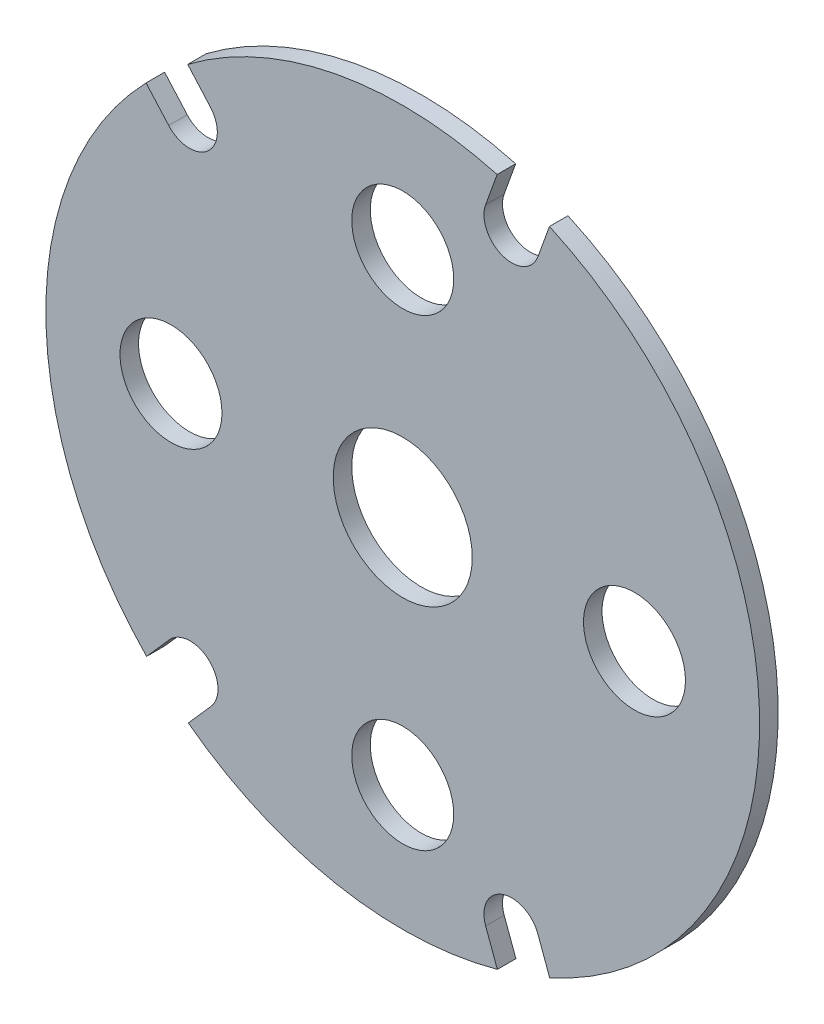
ISO-10303-21;
HEADER;
FILE_DESCRIPTION(('STEP AP214'),'2;1');
FILE_NAME('part.step','',(''),(''),'','','');
FILE_SCHEMA(('AUTOMOTIVE_DESIGN { 1 0 10303 214 1 1 1 1 }'));
ENDSEC;
DATA;
#1=APPLICATION_CONTEXT('core data for automotive mechanical design processes');
#2=APPLICATION_PROTOCOL_DEFINITION('international standard','automotive_design',2000,#1);
#3=PRODUCT_CONTEXT('',#1,'mechanical');
#4=PRODUCT('Part','Part','',(#3));
#5=PRODUCT_RELATED_PRODUCT_CATEGORY('part','',(#4));
#6=PRODUCT_DEFINITION_FORMATION('','',#4);
#7=PRODUCT_DEFINITION_CONTEXT('part definition',#1,'design');
#8=PRODUCT_DEFINITION('design','',#6,#7);
#9=PRODUCT_DEFINITION_SHAPE('','',#8);
#10=(LENGTH_UNIT() NAMED_UNIT(*) SI_UNIT(.MILLI.,.METRE.));
#11=(NAMED_UNIT(*) PLANE_ANGLE_UNIT() SI_UNIT($,.RADIAN.));
#12=(NAMED_UNIT(*) SI_UNIT($,.STERADIAN.) SOLID_ANGLE_UNIT());
#13=UNCERTAINTY_MEASURE_WITH_UNIT(LENGTH_MEASURE(1.E-05),#10,'distance_accuracy_value','');
#14=(GEOMETRIC_REPRESENTATION_CONTEXT(3) GLOBAL_UNCERTAINTY_ASSIGNED_CONTEXT((#13)) GLOBAL_UNIT_ASSIGNED_CONTEXT((#10,
#11,#12)) REPRESENTATION_CONTEXT('',''));
#15=CARTESIAN_POINT('',(0.,0.,0.));
#16=DIRECTION('',(0.,0.,1.));
#17=DIRECTION('',(1.,0.,0.));
#18=AXIS2_PLACEMENT_3D('',#15,#16,#17);
#19=CARTESIAN_POINT('',(0.,0.,2.));
#20=DIRECTION('',(0.,0.,-1.));
#21=DIRECTION('',(-1.,0.,0.));
#22=AXIS2_PLACEMENT_3D('',#19,#20,#21);
#23=PLANE('',#22);
#24=CARTESIAN_POINT('',(25.0000000000004,0.,2.));
#25=DIRECTION('',(0.,0.,1.));
#26=DIRECTION('',(1.,0.,0.));
#27=AXIS2_PLACEMENT_3D('',#24,#25,#26);
#28=CIRCLE('',#27,5.50000000000006);
#29=CARTESIAN_POINT('',(30.5000000000004,0.,2.));
#30=VERTEX_POINT('',#29);
#31=EDGE_CURVE('E348',#30,#30,#28,.T.);
#32=ORIENTED_EDGE('',*,*,#31,.F.);
#33=EDGE_LOOP('',(#32));
#34=FACE_BOUND('',#33,.T.);
#35=CARTESIAN_POINT('',(0.,24.9999999999999,2.));
#36=DIRECTION('',(0.,0.,1.));
#37=DIRECTION('',(1.,0.,0.));
#38=AXIS2_PLACEMENT_3D('',#35,#36,#37);
#39=CIRCLE('',#38,5.50000000000006);
#40=CARTESIAN_POINT('',(5.50000000000006,24.9999999999999,2.));
#41=VERTEX_POINT('',#40);
#42=EDGE_CURVE('E360',#41,#41,#39,.T.);
#43=ORIENTED_EDGE('',*,*,#42,.F.);
#44=EDGE_LOOP('',(#43));
#45=FACE_BOUND('',#44,.T.);
#46=CARTESIAN_POINT('',(0.,0.,2.));
#47=DIRECTION('',(0.,0.,1.));
#48=DIRECTION('',(-1.,0.,0.));
#49=AXIS2_PLACEMENT_3D('',#46,#47,#48);
#50=CIRCLE('',#49,38.5000000000003);
#51=CARTESIAN_POINT('',(10.183062278802,37.1289003692011,2.));
#52=VERTEX_POINT('',#51);
#53=CARTESIAN_POINT('',(-23.1958325761242,30.7278920705674,2.));
#54=VERTEX_POINT('',#53);
#55=EDGE_CURVE('E209',#52,#54,#50,.T.);
#56=ORIENTED_EDGE('',*,*,#55,.T.);
#57=DIRECTION('',(0.662848980359871,-0.748753116344686,0.));
#58=VECTOR('',#57,1.);
#59=CARTESIAN_POINT('',(-23.1958325761242,30.7278920705674,2.));
#60=LINE('',#59,#58);
#61=CARTESIAN_POINT('',(-20.7537406509684,27.9693090546173,2.));
#62=VERTEX_POINT('',#61);
#63=EDGE_CURVE('E117',#54,#62,#60,.T.);
#64=ORIENTED_EDGE('',*,*,#63,.T.);
#65=CARTESIAN_POINT('',(-23.0000000000027,25.9807621135375,2.));
#66=DIRECTION('',(0.,0.,-1.));
#67=DIRECTION('',(1.,0.,0.));
#68=AXIS2_PLACEMENT_3D('',#65,#66,#67);
#69=CIRCLE('',#68,3.00000000000025);
#70=CARTESIAN_POINT('',(-25.246259349037,23.9922151724578,2.));
#71=VERTEX_POINT('',#70);
#72=EDGE_CURVE('E248',#62,#71,#69,.T.);
#73=ORIENTED_EDGE('',*,*,#72,.T.);
#74=DIRECTION('',(-0.662848980359834,0.748753116344719,0.));
#75=VECTOR('',#74,1.);
#76=CARTESIAN_POINT('',(-27.6883512741927,26.7507981884081,2.));
#77=LINE('',#76,#75);
#78=CARTESIAN_POINT('',(-27.6883512741927,26.7507981884081,2.));
#79=VERTEX_POINT('',#78);
#80=EDGE_CURVE('E267',#71,#79,#77,.T.);
#81=ORIENTED_EDGE('',*,*,#80,.T.);
#82=CARTESIAN_POINT('',(0.,0.,2.));
#83=DIRECTION('',(0.,0.,1.));
#84=DIRECTION('',(1.,0.,0.));
#85=AXIS2_PLACEMENT_3D('',#82,#83,#84);
#86=CIRCLE('',#85,38.5000000000003);
#87=CARTESIAN_POINT('',(-27.63565024803,-26.8052389537677,2.));
#88=VERTEX_POINT('',#87);
#89=EDGE_CURVE('E264',#79,#88,#86,.T.);
#90=ORIENTED_EDGE('',*,*,#89,.T.);
#91=DIRECTION('',(0.661374099223641,0.750056198478566,0.));
#92=VECTOR('',#91,1.);
#93=CARTESIAN_POINT('',(-27.63565024803,-26.8052389537677,2.));
#94=LINE('',#93,#92);
#95=CARTESIAN_POINT('',(-25.1818791704065,-24.0224474767816,2.));
#96=VERTEX_POINT('',#95);
#97=EDGE_CURVE('E266',#88,#96,#94,.T.);
#98=ORIENTED_EDGE('',*,*,#97,.T.);
#99=CARTESIAN_POINT('',(-22.9317105749706,-26.0065697744526,2.));
#100=DIRECTION('',(0.,0.,-1.));
#101=DIRECTION('',(1.,0.,0.));
#102=AXIS2_PLACEMENT_3D('',#99,#100,#101);
#103=CIRCLE('',#102,3.00000000000024);
#104=CARTESIAN_POINT('',(-20.6815419795345,-27.9906920721235,2.));
#105=VERTEX_POINT('',#104);
#106=EDGE_CURVE('E269',#96,#105,#103,.T.);
#107=ORIENTED_EDGE('',*,*,#106,.T.);
#108=DIRECTION('',(-0.661374099223566,-0.750056198478631,0.));
#109=VECTOR('',#108,1.);
#110=CARTESIAN_POINT('',(-23.1353130571577,-30.7734835491099,2.));
#111=LINE('',#110,#109);
#112=CARTESIAN_POINT('',(-23.1353130571577,-30.7734835491099,2.));
#113=VERTEX_POINT('',#112);
#114=EDGE_CURVE('E275',#105,#113,#111,.T.);
#115=ORIENTED_EDGE('',*,*,#114,.T.);
#116=CARTESIAN_POINT('',(0.,0.,2.));
#117=DIRECTION('',(0.,0.,1.));
#118=DIRECTION('',(1.,0.,0.));
#119=AXIS2_PLACEMENT_3D('',#116,#117,#118);
#120=CIRCLE('',#119,38.5000000000004);
#121=CARTESIAN_POINT('',(10.2070277913581,-37.1223192118498,2.));
#122=VERTEX_POINT('',#121);
#123=EDGE_CURVE('E277',#113,#122,#120,.T.);
#124=ORIENTED_EDGE('',*,*,#123,.T.);
#125=DIRECTION('',(-0.345199557874812,0.938529309741062,0.));
#126=VECTOR('',#125,1.);
#127=CARTESIAN_POINT('',(8.94732951101925,-33.6974487838373,2.));
#128=LINE('',#127,#126);
#129=CARTESIAN_POINT('',(8.94732951101925,-33.6974487838373,2.));
#130=VERTEX_POINT('',#129);
#131=EDGE_CURVE('E279',#122,#130,#128,.T.);
#132=ORIENTED_EDGE('',*,*,#131,.T.);
#133=CARTESIAN_POINT('',(11.7628735507909,-32.6618662531496,2.));
#134=DIRECTION('',(0.,0.,-1.));
#135=DIRECTION('',(1.,0.,0.));
#136=AXIS2_PLACEMENT_3D('',#133,#134,#135);
#137=CIRCLE('',#136,2.99995323592874);
#138=CARTESIAN_POINT('',(14.5784175905626,-31.6262837224619,2.));
#139=VERTEX_POINT('',#138);
#140=EDGE_CURVE('E281',#130,#139,#137,.T.);
#141=ORIENTED_EDGE('',*,*,#140,.T.);
#142=DIRECTION('',(0.345199557874793,-0.938529309741069,0.));
#143=VECTOR('',#142,1.);
#144=CARTESIAN_POINT('',(14.5784175905626,-31.6262837224619,2.));
#145=LINE('',#144,#143);
#146=CARTESIAN_POINT('',(15.8508000899225,-35.0856400327732,2.));
#147=VERTEX_POINT('',#146);
#148=EDGE_CURVE('E283',#139,#147,#145,.T.);
#149=ORIENTED_EDGE('',*,*,#148,.T.);
#150=CARTESIAN_POINT('',(0.,0.,2.));
#151=DIRECTION('',(0.,0.,1.));
#152=DIRECTION('',(1.,0.,0.));
#153=AXIS2_PLACEMENT_3D('',#150,#151,#152);
#154=CIRCLE('',#153,38.5000000000003);
#155=CARTESIAN_POINT('',(15.8280452499176,35.0959112086663,2.));
#156=VERTEX_POINT('',#155);
#157=EDGE_CURVE('E160',#147,#156,#154,.T.);
#158=ORIENTED_EDGE('',*,*,#157,.T.);
#159=DIRECTION('',(-0.338836808552034,-0.940845161102651,0.));
#160=VECTOR('',#159,1.);
#161=CARTESIAN_POINT('',(14.5853650363487,31.645372081201,2.));
#162=LINE('',#161,#160);
#163=CARTESIAN_POINT('',(14.5853650363487,31.645372081201,2.));
#164=VERTEX_POINT('',#163);
#165=EDGE_CURVE('E154',#156,#164,#162,.T.);
#166=ORIENTED_EDGE('',*,*,#165,.T.);
#167=CARTESIAN_POINT('',(11.7628735507909,32.6618666614685,2.));
#168=DIRECTION('',(0.,0.,-1.));
#169=DIRECTION('',(1.,0.,0.));
#170=AXIS2_PLACEMENT_3D('',#167,#168,#169);
#171=CIRCLE('',#170,2.99995323592874);
#172=CARTESIAN_POINT('',(8.94038206523313,33.6783612417359,2.));
#173=VERTEX_POINT('',#172);
#174=EDGE_CURVE('E158',#164,#173,#171,.T.);
#175=ORIENTED_EDGE('',*,*,#174,.T.);
#176=DIRECTION('',(0.338836808552033,0.940845161102651,0.));
#177=VECTOR('',#176,1.);
#178=CARTESIAN_POINT('',(8.94038206523313,33.6783612417359,2.));
#179=LINE('',#178,#177);
#180=EDGE_CURVE('E50',#173,#52,#179,.T.);
#181=ORIENTED_EDGE('',*,*,#180,.T.);
#182=EDGE_LOOP('',(#56,#64,#73,#81,#90,#98,#107,#115,#124,#132,#141,#149,#158,#166,#175,#181));
#183=FACE_BOUND('',#182,.T.);
#184=CARTESIAN_POINT('',(-24.9999999999999,0.,2.));
#185=DIRECTION('',(0.,0.,1.));
#186=DIRECTION('',(1.,0.,0.));
#187=AXIS2_PLACEMENT_3D('',#184,#185,#186);
#188=CIRCLE('',#187,5.50000000000006);
#189=CARTESIAN_POINT('',(-19.4999999999998,0.,2.));
#190=VERTEX_POINT('',#189);
#191=EDGE_CURVE('E182',#190,#190,#188,.T.);
#192=ORIENTED_EDGE('',*,*,#191,.F.);
#193=EDGE_LOOP('',(#192));
#194=FACE_BOUND('',#193,.T.);
#195=CARTESIAN_POINT('',(0.,-25.0000000000001,2.));
#196=DIRECTION('',(0.,0.,1.));
#197=DIRECTION('',(1.,0.,0.));
#198=AXIS2_PLACEMENT_3D('',#195,#196,#197);
#199=CIRCLE('',#198,5.50000000000006);
#200=CARTESIAN_POINT('',(5.50000000000006,-25.0000000000001,2.));
#201=VERTEX_POINT('',#200);
#202=EDGE_CURVE('E354',#201,#201,#199,.T.);
#203=ORIENTED_EDGE('',*,*,#202,.F.);
#204=EDGE_LOOP('',(#203));
#205=FACE_BOUND('',#204,.T.);
#206=CARTESIAN_POINT('',(0.,0.,2.));
#207=DIRECTION('',(0.,0.,1.));
#208=DIRECTION('',(1.,0.,0.));
#209=AXIS2_PLACEMENT_3D('',#206,#207,#208);
#210=CIRCLE('',#209,7.49999999999984);
#211=CARTESIAN_POINT('',(7.49999999999984,0.,2.));
#212=VERTEX_POINT('',#211);
#213=EDGE_CURVE('E339',#212,#212,#210,.T.);
#214=ORIENTED_EDGE('',*,*,#213,.F.);
#215=EDGE_LOOP('',(#214));
#216=FACE_BOUND('',#215,.T.);
#217=ADVANCED_FACE('F33',(#34,#45,#183,#194,#205,#216),#23,.F.);
#218=CARTESIAN_POINT('',(0.,0.,0.));
#219=DIRECTION('',(0.,0.,-1.));
#220=DIRECTION('',(-1.,0.,0.));
#221=AXIS2_PLACEMENT_3D('',#218,#219,#220);
#222=PLANE('',#221);
#223=CARTESIAN_POINT('',(25.0000000000004,0.,0.));
#224=DIRECTION('',(0.,0.,1.));
#225=DIRECTION('',(1.,0.,0.));
#226=AXIS2_PLACEMENT_3D('',#223,#224,#225);
#227=CIRCLE('',#226,5.50000000000006);
#228=CARTESIAN_POINT('',(30.5000000000004,0.,0.));
#229=VERTEX_POINT('',#228);
#230=EDGE_CURVE('E345',#229,#229,#227,.T.);
#231=ORIENTED_EDGE('',*,*,#230,.T.);
#232=EDGE_LOOP('',(#231));
#233=FACE_BOUND('',#232,.T.);
#234=CARTESIAN_POINT('',(0.,24.9999999999999,0.));
#235=DIRECTION('',(0.,0.,1.));
#236=DIRECTION('',(1.,0.,0.));
#237=AXIS2_PLACEMENT_3D('',#234,#235,#236);
#238=CIRCLE('',#237,5.50000000000006);
#239=CARTESIAN_POINT('',(5.50000000000006,24.9999999999999,0.));
#240=VERTEX_POINT('',#239);
#241=EDGE_CURVE('E357',#240,#240,#238,.T.);
#242=ORIENTED_EDGE('',*,*,#241,.T.);
#243=EDGE_LOOP('',(#242));
#244=FACE_BOUND('',#243,.T.);
#245=CARTESIAN_POINT('',(0.,0.,0.));
#246=DIRECTION('',(0.,0.,1.));
#247=DIRECTION('',(-1.,0.,0.));
#248=AXIS2_PLACEMENT_3D('',#245,#246,#247);
#249=CIRCLE('',#248,38.5000000000003);
#250=CARTESIAN_POINT('',(10.183062278802,37.1289003692011,0.));
#251=VERTEX_POINT('',#250);
#252=CARTESIAN_POINT('',(-23.1958325761242,30.7278920705674,0.));
#253=VERTEX_POINT('',#252);
#254=EDGE_CURVE('E178',#251,#253,#249,.T.);
#255=ORIENTED_EDGE('',*,*,#254,.F.);
#256=DIRECTION('',(0.338836808552033,0.940845161102651,0.));
#257=VECTOR('',#256,1.);
#258=CARTESIAN_POINT('',(8.94038206523313,33.6783612417359,0.));
#259=LINE('',#258,#257);
#260=CARTESIAN_POINT('',(8.94038206523313,33.6783612417359,0.));
#261=VERTEX_POINT('',#260);
#262=EDGE_CURVE('E109',#261,#251,#259,.T.);
#263=ORIENTED_EDGE('',*,*,#262,.F.);
#264=CARTESIAN_POINT('',(11.7628735507909,32.6618666614685,0.));
#265=DIRECTION('',(0.,0.,-1.));
#266=DIRECTION('',(1.,0.,0.));
#267=AXIS2_PLACEMENT_3D('',#264,#265,#266);
#268=CIRCLE('',#267,2.99995323592874);
#269=CARTESIAN_POINT('',(14.5853650363487,31.645372081201,0.));
#270=VERTEX_POINT('',#269);
#271=EDGE_CURVE('E103',#270,#261,#268,.T.);
#272=ORIENTED_EDGE('',*,*,#271,.F.);
#273=DIRECTION('',(-0.338836808552034,-0.940845161102651,0.));
#274=VECTOR('',#273,1.);
#275=CARTESIAN_POINT('',(14.5853650363487,31.645372081201,0.));
#276=LINE('',#275,#274);
#277=CARTESIAN_POINT('',(15.8280452499176,35.0959112086663,0.));
#278=VERTEX_POINT('',#277);
#279=EDGE_CURVE('E168',#278,#270,#276,.T.);
#280=ORIENTED_EDGE('',*,*,#279,.F.);
#281=CARTESIAN_POINT('',(0.,0.,0.));
#282=DIRECTION('',(0.,0.,1.));
#283=DIRECTION('',(1.,0.,0.));
#284=AXIS2_PLACEMENT_3D('',#281,#282,#283);
#285=CIRCLE('',#284,38.5000000000003);
#286=CARTESIAN_POINT('',(15.8508000899225,-35.0856400327732,0.));
#287=VERTEX_POINT('',#286);
#288=EDGE_CURVE('E204',#287,#278,#285,.T.);
#289=ORIENTED_EDGE('',*,*,#288,.F.);
#290=DIRECTION('',(0.345199557874793,-0.938529309741069,0.));
#291=VECTOR('',#290,1.);
#292=CARTESIAN_POINT('',(14.5784175905626,-31.6262837224619,0.));
#293=LINE('',#292,#291);
#294=CARTESIAN_POINT('',(14.5784175905626,-31.6262837224619,0.));
#295=VERTEX_POINT('',#294);
#296=EDGE_CURVE('E202',#295,#287,#293,.T.);
#297=ORIENTED_EDGE('',*,*,#296,.F.);
#298=CARTESIAN_POINT('',(11.7628735507909,-32.6618662531496,0.));
#299=DIRECTION('',(0.,0.,-1.));
#300=DIRECTION('',(1.,0.,0.));
#301=AXIS2_PLACEMENT_3D('',#298,#299,#300);
#302=CIRCLE('',#301,2.99995323592874);
#303=CARTESIAN_POINT('',(8.94732951101925,-33.6974487838373,0.));
#304=VERTEX_POINT('',#303);
#305=EDGE_CURVE('E200',#304,#295,#302,.T.);
#306=ORIENTED_EDGE('',*,*,#305,.F.);
#307=DIRECTION('',(-0.345199557874812,0.938529309741062,0.));
#308=VECTOR('',#307,1.);
#309=CARTESIAN_POINT('',(8.94732951101925,-33.6974487838373,0.));
#310=LINE('',#309,#308);
#311=CARTESIAN_POINT('',(10.2070277913581,-37.1223192118498,0.));
#312=VERTEX_POINT('',#311);
#313=EDGE_CURVE('E198',#312,#304,#310,.T.);
#314=ORIENTED_EDGE('',*,*,#313,.F.);
#315=CARTESIAN_POINT('',(0.,0.,0.));
#316=DIRECTION('',(0.,0.,1.));
#317=DIRECTION('',(1.,0.,0.));
#318=AXIS2_PLACEMENT_3D('',#315,#316,#317);
#319=CIRCLE('',#318,38.5000000000004);
#320=CARTESIAN_POINT('',(-23.1353130571577,-30.7734835491099,0.));
#321=VERTEX_POINT('',#320);
#322=EDGE_CURVE('E196',#321,#312,#319,.T.);
#323=ORIENTED_EDGE('',*,*,#322,.F.);
#324=DIRECTION('',(-0.661374099223566,-0.750056198478631,0.));
#325=VECTOR('',#324,1.);
#326=CARTESIAN_POINT('',(-23.1353130571577,-30.7734835491099,0.));
#327=LINE('',#326,#325);
#328=CARTESIAN_POINT('',(-20.6815419795345,-27.9906920721235,0.));
#329=VERTEX_POINT('',#328);
#330=EDGE_CURVE('E194',#329,#321,#327,.T.);
#331=ORIENTED_EDGE('',*,*,#330,.F.);
#332=CARTESIAN_POINT('',(-22.9317105749706,-26.0065697744526,0.));
#333=DIRECTION('',(0.,0.,-1.));
#334=DIRECTION('',(1.,0.,0.));
#335=AXIS2_PLACEMENT_3D('',#332,#333,#334);
#336=CIRCLE('',#335,3.00000000000024);
#337=CARTESIAN_POINT('',(-25.1818791704065,-24.0224474767816,0.));
#338=VERTEX_POINT('',#337);
#339=EDGE_CURVE('E192',#338,#329,#336,.T.);
#340=ORIENTED_EDGE('',*,*,#339,.F.);
#341=DIRECTION('',(0.661374099223641,0.750056198478566,0.));
#342=VECTOR('',#341,1.);
#343=CARTESIAN_POINT('',(-27.63565024803,-26.8052389537677,0.));
#344=LINE('',#343,#342);
#345=CARTESIAN_POINT('',(-27.63565024803,-26.8052389537677,0.));
#346=VERTEX_POINT('',#345);
#347=EDGE_CURVE('E190',#346,#338,#344,.T.);
#348=ORIENTED_EDGE('',*,*,#347,.F.);
#349=CARTESIAN_POINT('',(0.,0.,0.));
#350=DIRECTION('',(0.,0.,1.));
#351=DIRECTION('',(1.,0.,0.));
#352=AXIS2_PLACEMENT_3D('',#349,#350,#351);
#353=CIRCLE('',#352,38.5000000000003);
#354=CARTESIAN_POINT('',(-27.6883512741927,26.7507981884081,0.));
#355=VERTEX_POINT('',#354);
#356=EDGE_CURVE('E188',#355,#346,#353,.T.);
#357=ORIENTED_EDGE('',*,*,#356,.F.);
#358=DIRECTION('',(-0.662848980359834,0.748753116344719,0.));
#359=VECTOR('',#358,1.);
#360=CARTESIAN_POINT('',(-27.6883512741927,26.7507981884081,0.));
#361=LINE('',#360,#359);
#362=CARTESIAN_POINT('',(-25.246259349037,23.9922151724578,0.));
#363=VERTEX_POINT('',#362);
#364=EDGE_CURVE('E186',#363,#355,#361,.T.);
#365=ORIENTED_EDGE('',*,*,#364,.F.);
#366=CARTESIAN_POINT('',(-23.0000000000027,25.9807621135375,0.));
#367=DIRECTION('',(0.,0.,-1.));
#368=DIRECTION('',(1.,0.,0.));
#369=AXIS2_PLACEMENT_3D('',#366,#367,#368);
#370=CIRCLE('',#369,3.00000000000025);
#371=CARTESIAN_POINT('',(-20.7537406509684,27.9693090546173,0.));
#372=VERTEX_POINT('',#371);
#373=EDGE_CURVE('E184',#372,#363,#370,.T.);
#374=ORIENTED_EDGE('',*,*,#373,.F.);
#375=DIRECTION('',(0.662848980359871,-0.748753116344686,0.));
#376=VECTOR('',#375,1.);
#377=CARTESIAN_POINT('',(-23.1958325761242,30.7278920705674,0.));
#378=LINE('',#377,#376);
#379=EDGE_CURVE('E181',#253,#372,#378,.T.);
#380=ORIENTED_EDGE('',*,*,#379,.F.);
#381=EDGE_LOOP('',(#255,#263,#272,#280,#289,#297,#306,#314,#323,#331,#340,#348,#357,#365,#374,#380));
#382=FACE_BOUND('',#381,.T.);
#383=CARTESIAN_POINT('',(-24.9999999999999,0.,0.));
#384=DIRECTION('',(0.,0.,1.));
#385=DIRECTION('',(1.,0.,0.));
#386=AXIS2_PLACEMENT_3D('',#383,#384,#385);
#387=CIRCLE('',#386,5.50000000000006);
#388=CARTESIAN_POINT('',(-19.4999999999998,0.,0.));
#389=VERTEX_POINT('',#388);
#390=EDGE_CURVE('E363',#389,#389,#387,.T.);
#391=ORIENTED_EDGE('',*,*,#390,.T.);
#392=EDGE_LOOP('',(#391));
#393=FACE_BOUND('',#392,.T.);
#394=CARTESIAN_POINT('',(0.,-25.0000000000001,0.));
#395=DIRECTION('',(0.,0.,1.));
#396=DIRECTION('',(1.,0.,0.));
#397=AXIS2_PLACEMENT_3D('',#394,#395,#396);
#398=CIRCLE('',#397,5.50000000000006);
#399=CARTESIAN_POINT('',(5.50000000000006,-25.0000000000001,0.));
#400=VERTEX_POINT('',#399);
#401=EDGE_CURVE('E351',#400,#400,#398,.T.);
#402=ORIENTED_EDGE('',*,*,#401,.T.);
#403=EDGE_LOOP('',(#402));
#404=FACE_BOUND('',#403,.T.);
#405=CARTESIAN_POINT('',(0.,0.,0.));
#406=DIRECTION('',(0.,0.,1.));
#407=DIRECTION('',(1.,0.,0.));
#408=AXIS2_PLACEMENT_3D('',#405,#406,#407);
#409=CIRCLE('',#408,7.49999999999984);
#410=CARTESIAN_POINT('',(7.49999999999984,0.,0.));
#411=VERTEX_POINT('',#410);
#412=EDGE_CURVE('E342',#411,#411,#409,.T.);
#413=ORIENTED_EDGE('',*,*,#412,.T.);
#414=EDGE_LOOP('',(#413));
#415=FACE_BOUND('',#414,.T.);
#416=ADVANCED_FACE('F252',(#233,#244,#382,#393,#404,#415),#222,.T.);
#417=CARTESIAN_POINT('',(0.,0.,2.));
#418=DIRECTION('',(0.,0.,-1.));
#419=DIRECTION('',(-1.,0.,0.));
#420=AXIS2_PLACEMENT_3D('',#417,#418,#419);
#421=CYLINDRICAL_SURFACE('',#420,38.5000000000003);
#422=ORIENTED_EDGE('',*,*,#254,.T.);
#423=DIRECTION('',(0.,0.,-1.));
#424=VECTOR('',#423,1.);
#425=CARTESIAN_POINT('',(-23.1958325761242,30.7278920705674,2.));
#426=LINE('',#425,#424);
#427=EDGE_CURVE('E11',#54,#253,#426,.T.);
#428=ORIENTED_EDGE('',*,*,#427,.F.);
#429=ORIENTED_EDGE('',*,*,#55,.F.);
#430=DIRECTION('',(0.,0.,-1.));
#431=VECTOR('',#430,1.);
#432=CARTESIAN_POINT('',(10.183062278802,37.1289003692011,2.));
#433=LINE('',#432,#431);
#434=EDGE_CURVE('E174',#52,#251,#433,.T.);
#435=ORIENTED_EDGE('',*,*,#434,.T.);
#436=EDGE_LOOP('',(#422,#428,#429,#435));
#437=FACE_BOUND('',#436,.T.);
#438=ADVANCED_FACE('F35',(#437),#421,.T.);
#439=CARTESIAN_POINT('',(-23.1958325761242,30.7278920705674,2.));
#440=DIRECTION('',(0.748753116344686,0.662848980359872,0.));
#441=DIRECTION('',(-0.662848980359872,0.748753116344686,0.));
#442=AXIS2_PLACEMENT_3D('',#439,#440,#441);
#443=PLANE('',#442);
#444=ORIENTED_EDGE('',*,*,#379,.T.);
#445=DIRECTION('',(0.,0.,-1.));
#446=VECTOR('',#445,1.);
#447=CARTESIAN_POINT('',(-20.7537406509684,27.9693090546173,2.));
#448=LINE('',#447,#446);
#449=EDGE_CURVE('E42',#62,#372,#448,.T.);
#450=ORIENTED_EDGE('',*,*,#449,.F.);
#451=ORIENTED_EDGE('',*,*,#63,.F.);
#452=ORIENTED_EDGE('',*,*,#427,.T.);
#453=EDGE_LOOP('',(#444,#450,#451,#452));
#454=FACE_BOUND('',#453,.T.);
#455=ADVANCED_FACE('F521',(#454),#443,.F.);
#456=CARTESIAN_POINT('',(-23.0000000000027,25.9807621135375,2.));
#457=DIRECTION('',(0.,0.,-1.));
#458=DIRECTION('',(-1.,0.,0.));
#459=AXIS2_PLACEMENT_3D('',#456,#457,#458);
#460=CYLINDRICAL_SURFACE('',#459,3.00000000000025);
#461=ORIENTED_EDGE('',*,*,#373,.T.);
#462=DIRECTION('',(0.,0.,-1.));
#463=VECTOR('',#462,1.);
#464=CARTESIAN_POINT('',(-25.246259349037,23.9922151724578,2.));
#465=LINE('',#464,#463);
#466=EDGE_CURVE('E240',#71,#363,#465,.T.);
#467=ORIENTED_EDGE('',*,*,#466,.F.);
#468=ORIENTED_EDGE('',*,*,#72,.F.);
#469=ORIENTED_EDGE('',*,*,#449,.T.);
#470=EDGE_LOOP('',(#461,#467,#468,#469));
#471=FACE_BOUND('',#470,.T.);
#472=ADVANCED_FACE('F246',(#471),#460,.F.);
#473=CARTESIAN_POINT('',(-27.6883512741927,26.7507981884081,2.));
#474=DIRECTION('',(-0.748753116344719,-0.662848980359834,0.));
#475=DIRECTION('',(0.662848980359834,-0.748753116344719,0.));
#476=AXIS2_PLACEMENT_3D('',#473,#474,#475);
#477=PLANE('',#476);
#478=ORIENTED_EDGE('',*,*,#364,.T.);
#479=DIRECTION('',(0.,0.,-1.));
#480=VECTOR('',#479,1.);
#481=CARTESIAN_POINT('',(-27.6883512741927,26.7507981884081,2.));
#482=LINE('',#481,#480);
#483=EDGE_CURVE('E237',#79,#355,#482,.T.);
#484=ORIENTED_EDGE('',*,*,#483,.F.);
#485=ORIENTED_EDGE('',*,*,#80,.F.);
#486=ORIENTED_EDGE('',*,*,#466,.T.);
#487=EDGE_LOOP('',(#478,#484,#485,#486));
#488=FACE_BOUND('',#487,.T.);
#489=ADVANCED_FACE('F258',(#488),#477,.F.);
#490=CARTESIAN_POINT('',(0.,0.,2.));
#491=DIRECTION('',(0.,0.,-1.));
#492=DIRECTION('',(-1.,0.,0.));
#493=AXIS2_PLACEMENT_3D('',#490,#491,#492);
#494=CYLINDRICAL_SURFACE('',#493,38.5000000000003);
#495=ORIENTED_EDGE('',*,*,#356,.T.);
#496=DIRECTION('',(0.,0.,-1.));
#497=VECTOR('',#496,1.);
#498=CARTESIAN_POINT('',(-27.63565024803,-26.8052389537677,2.));
#499=LINE('',#498,#497);
#500=EDGE_CURVE('E234',#88,#346,#499,.T.);
#501=ORIENTED_EDGE('',*,*,#500,.F.);
#502=ORIENTED_EDGE('',*,*,#89,.F.);
#503=ORIENTED_EDGE('',*,*,#483,.T.);
#504=EDGE_LOOP('',(#495,#501,#502,#503));
#505=FACE_BOUND('',#504,.T.);
#506=ADVANCED_FACE('F262',(#505),#494,.T.);
#507=CARTESIAN_POINT('',(-27.63565024803,-26.8052389537677,2.));
#508=DIRECTION('',(-0.750056198478566,0.661374099223641,0.));
#509=DIRECTION('',(-0.661374099223641,-0.750056198478566,0.));
#510=AXIS2_PLACEMENT_3D('',#507,#508,#509);
#511=PLANE('',#510);
#512=ORIENTED_EDGE('',*,*,#347,.T.);
#513=DIRECTION('',(0.,0.,-1.));
#514=VECTOR('',#513,1.);
#515=CARTESIAN_POINT('',(-25.1818791704065,-24.0224474767816,2.));
#516=LINE('',#515,#514);
#517=EDGE_CURVE('E231',#96,#338,#516,.T.);
#518=ORIENTED_EDGE('',*,*,#517,.F.);
#519=ORIENTED_EDGE('',*,*,#97,.F.);
#520=ORIENTED_EDGE('',*,*,#500,.T.);
#521=EDGE_LOOP('',(#512,#518,#519,#520));
#522=FACE_BOUND('',#521,.T.);
#523=ADVANCED_FACE('F486',(#522),#511,.F.);
#524=CARTESIAN_POINT('',(-22.9317105749706,-26.0065697744526,2.));
#525=DIRECTION('',(0.,0.,-1.));
#526=DIRECTION('',(-1.,0.,0.));
#527=AXIS2_PLACEMENT_3D('',#524,#525,#526);
#528=CYLINDRICAL_SURFACE('',#527,3.00000000000024);
#529=ORIENTED_EDGE('',*,*,#339,.T.);
#530=DIRECTION('',(0.,0.,-1.));
#531=VECTOR('',#530,1.);
#532=CARTESIAN_POINT('',(-20.6815419795345,-27.9906920721235,2.));
#533=LINE('',#532,#531);
#534=EDGE_CURVE('E228',#105,#329,#533,.T.);
#535=ORIENTED_EDGE('',*,*,#534,.F.);
#536=ORIENTED_EDGE('',*,*,#106,.F.);
#537=ORIENTED_EDGE('',*,*,#517,.T.);
#538=EDGE_LOOP('',(#529,#535,#536,#537));
#539=FACE_BOUND('',#538,.T.);
#540=ADVANCED_FACE('F476',(#539),#528,.F.);
#541=CARTESIAN_POINT('',(-23.1353130571577,-30.7734835491099,2.));
#542=DIRECTION('',(0.750056198478631,-0.661374099223566,0.));
#543=DIRECTION('',(0.661374099223566,0.750056198478631,0.));
#544=AXIS2_PLACEMENT_3D('',#541,#542,#543);
#545=PLANE('',#544);
#546=ORIENTED_EDGE('',*,*,#330,.T.);
#547=DIRECTION('',(0.,0.,-1.));
#548=VECTOR('',#547,1.);
#549=CARTESIAN_POINT('',(-23.1353130571577,-30.7734835491099,2.));
#550=LINE('',#549,#548);
#551=EDGE_CURVE('E225',#113,#321,#550,.T.);
#552=ORIENTED_EDGE('',*,*,#551,.F.);
#553=ORIENTED_EDGE('',*,*,#114,.F.);
#554=ORIENTED_EDGE('',*,*,#534,.T.);
#555=EDGE_LOOP('',(#546,#552,#553,#554));
#556=FACE_BOUND('',#555,.T.);
#557=ADVANCED_FACE('F466',(#556),#545,.F.);
#558=CARTESIAN_POINT('',(0.,0.,2.));
#559=DIRECTION('',(0.,0.,-1.));
#560=DIRECTION('',(-1.,0.,0.));
#561=AXIS2_PLACEMENT_3D('',#558,#559,#560);
#562=CYLINDRICAL_SURFACE('',#561,38.5000000000004);
#563=ORIENTED_EDGE('',*,*,#322,.T.);
#564=DIRECTION('',(0.,0.,-1.));
#565=VECTOR('',#564,1.);
#566=CARTESIAN_POINT('',(10.2070277913581,-37.1223192118498,2.));
#567=LINE('',#566,#565);
#568=EDGE_CURVE('E222',#122,#312,#567,.T.);
#569=ORIENTED_EDGE('',*,*,#568,.F.);
#570=ORIENTED_EDGE('',*,*,#123,.F.);
#571=ORIENTED_EDGE('',*,*,#551,.T.);
#572=EDGE_LOOP('',(#563,#569,#570,#571));
#573=FACE_BOUND('',#572,.T.);
#574=ADVANCED_FACE('F456',(#573),#562,.T.);
#575=CARTESIAN_POINT('',(8.94732951101925,-33.6974487838373,2.));
#576=DIRECTION('',(-0.938529309741062,-0.345199557874812,0.));
#577=DIRECTION('',(0.345199557874812,-0.938529309741062,0.));
#578=AXIS2_PLACEMENT_3D('',#575,#576,#577);
#579=PLANE('',#578);
#580=ORIENTED_EDGE('',*,*,#313,.T.);
#581=DIRECTION('',(0.,0.,-1.));
#582=VECTOR('',#581,1.);
#583=CARTESIAN_POINT('',(8.94732951101925,-33.6974487838373,2.));
#584=LINE('',#583,#582);
#585=EDGE_CURVE('E219',#130,#304,#584,.T.);
#586=ORIENTED_EDGE('',*,*,#585,.F.);
#587=ORIENTED_EDGE('',*,*,#131,.F.);
#588=ORIENTED_EDGE('',*,*,#568,.T.);
#589=EDGE_LOOP('',(#580,#586,#587,#588));
#590=FACE_BOUND('',#589,.T.);
#591=ADVANCED_FACE('F446',(#590),#579,.F.);
#592=CARTESIAN_POINT('',(11.7628735507909,-32.6618662531496,2.));
#593=DIRECTION('',(0.,0.,-1.));
#594=DIRECTION('',(-1.,0.,0.));
#595=AXIS2_PLACEMENT_3D('',#592,#593,#594);
#596=CYLINDRICAL_SURFACE('',#595,2.99995323592874);
#597=ORIENTED_EDGE('',*,*,#305,.T.);
#598=DIRECTION('',(0.,0.,-1.));
#599=VECTOR('',#598,1.);
#600=CARTESIAN_POINT('',(14.5784175905626,-31.6262837224619,2.));
#601=LINE('',#600,#599);
#602=EDGE_CURVE('E216',#139,#295,#601,.T.);
#603=ORIENTED_EDGE('',*,*,#602,.F.);
#604=ORIENTED_EDGE('',*,*,#140,.F.);
#605=ORIENTED_EDGE('',*,*,#585,.T.);
#606=EDGE_LOOP('',(#597,#603,#604,#605));
#607=FACE_BOUND('',#606,.T.);
#608=ADVANCED_FACE('F437',(#607),#596,.F.);
#609=CARTESIAN_POINT('',(14.5784175905626,-31.6262837224619,2.));
#610=DIRECTION('',(0.938529309741069,0.345199557874793,0.));
#611=DIRECTION('',(-0.345199557874793,0.938529309741069,0.));
#612=AXIS2_PLACEMENT_3D('',#609,#610,#611);
#613=PLANE('',#612);
#614=ORIENTED_EDGE('',*,*,#296,.T.);
#615=DIRECTION('',(0.,0.,-1.));
#616=VECTOR('',#615,1.);
#617=CARTESIAN_POINT('',(15.8508000899225,-35.0856400327732,2.));
#618=LINE('',#617,#616);
#619=EDGE_CURVE('E213',#147,#287,#618,.T.);
#620=ORIENTED_EDGE('',*,*,#619,.F.);
#621=ORIENTED_EDGE('',*,*,#148,.F.);
#622=ORIENTED_EDGE('',*,*,#602,.T.);
#623=EDGE_LOOP('',(#614,#620,#621,#622));
#624=FACE_BOUND('',#623,.T.);
#625=ADVANCED_FACE('F289',(#624),#613,.F.);
#626=CARTESIAN_POINT('',(0.,0.,2.));
#627=DIRECTION('',(0.,0.,-1.));
#628=DIRECTION('',(-1.,0.,0.));
#629=AXIS2_PLACEMENT_3D('',#626,#627,#628);
#630=CYLINDRICAL_SURFACE('',#629,38.5000000000003);
#631=ORIENTED_EDGE('',*,*,#288,.T.);
#632=DIRECTION('',(0.,0.,-1.));
#633=VECTOR('',#632,1.);
#634=CARTESIAN_POINT('',(15.8280452499176,35.0959112086663,2.));
#635=LINE('',#634,#633);
#636=EDGE_CURVE('E169',#156,#278,#635,.T.);
#637=ORIENTED_EDGE('',*,*,#636,.F.);
#638=ORIENTED_EDGE('',*,*,#157,.F.);
#639=ORIENTED_EDGE('',*,*,#619,.T.);
#640=EDGE_LOOP('',(#631,#637,#638,#639));
#641=FACE_BOUND('',#640,.T.);
#642=ADVANCED_FACE('F293',(#641),#630,.T.);
#643=CARTESIAN_POINT('',(14.5853650363487,31.645372081201,2.));
#644=DIRECTION('',(0.940845161102651,-0.338836808552034,0.));
#645=DIRECTION('',(0.338836808552034,0.940845161102651,0.));
#646=AXIS2_PLACEMENT_3D('',#643,#644,#645);
#647=PLANE('',#646);
#648=ORIENTED_EDGE('',*,*,#279,.T.);
#649=DIRECTION('',(0.,0.,-1.));
#650=VECTOR('',#649,1.);
#651=CARTESIAN_POINT('',(14.5853650363487,31.645372081201,2.));
#652=LINE('',#651,#650);
#653=EDGE_CURVE('E165',#164,#270,#652,.T.);
#654=ORIENTED_EDGE('',*,*,#653,.F.);
#655=ORIENTED_EDGE('',*,*,#165,.F.);
#656=ORIENTED_EDGE('',*,*,#636,.T.);
#657=EDGE_LOOP('',(#648,#654,#655,#656));
#658=FACE_BOUND('',#657,.T.);
#659=ADVANCED_FACE('F166',(#658),#647,.F.);
#660=CARTESIAN_POINT('',(11.7628735507909,32.6618666614685,2.));
#661=DIRECTION('',(0.,0.,-1.));
#662=DIRECTION('',(-1.,0.,0.));
#663=AXIS2_PLACEMENT_3D('',#660,#661,#662);
#664=CYLINDRICAL_SURFACE('',#663,2.99995323592874);
#665=ORIENTED_EDGE('',*,*,#271,.T.);
#666=DIRECTION('',(0.,0.,-1.));
#667=VECTOR('',#666,1.);
#668=CARTESIAN_POINT('',(8.94038206523313,33.6783612417359,2.));
#669=LINE('',#668,#667);
#670=EDGE_CURVE('E170',#173,#261,#669,.T.);
#671=ORIENTED_EDGE('',*,*,#670,.F.);
#672=ORIENTED_EDGE('',*,*,#174,.F.);
#673=ORIENTED_EDGE('',*,*,#653,.T.);
#674=EDGE_LOOP('',(#665,#671,#672,#673));
#675=FACE_BOUND('',#674,.T.);
#676=ADVANCED_FACE('F172',(#675),#664,.F.);
#677=CARTESIAN_POINT('',(8.94038206523313,33.6783612417359,2.));
#678=DIRECTION('',(-0.940845161102651,0.338836808552033,0.));
#679=DIRECTION('',(-0.338836808552033,-0.940845161102651,0.));
#680=AXIS2_PLACEMENT_3D('',#677,#678,#679);
#681=PLANE('',#680);
#682=ORIENTED_EDGE('',*,*,#262,.T.);
#683=ORIENTED_EDGE('',*,*,#434,.F.);
#684=ORIENTED_EDGE('',*,*,#180,.F.);
#685=ORIENTED_EDGE('',*,*,#670,.T.);
#686=EDGE_LOOP('',(#682,#683,#684,#685));
#687=FACE_BOUND('',#686,.T.);
#688=ADVANCED_FACE('F297',(#687),#681,.F.);
#689=CARTESIAN_POINT('',(-24.9999999999999,0.,2.));
#690=DIRECTION('',(0.,0.,-1.));
#691=DIRECTION('',(-1.,0.,0.));
#692=AXIS2_PLACEMENT_3D('',#689,#690,#691);
#693=CYLINDRICAL_SURFACE('',#692,5.50000000000006);
#694=ORIENTED_EDGE('',*,*,#191,.T.);
#695=EDGE_LOOP('',(#694));
#696=FACE_BOUND('',#695,.T.);
#697=ORIENTED_EDGE('',*,*,#390,.F.);
#698=EDGE_LOOP('',(#697));
#699=FACE_BOUND('',#698,.T.);
#700=ADVANCED_FACE('F299',(#696,#699),#693,.F.);
#701=CARTESIAN_POINT('',(0.,24.9999999999999,2.));
#702=DIRECTION('',(0.,0.,-1.));
#703=DIRECTION('',(-1.,0.,0.));
#704=AXIS2_PLACEMENT_3D('',#701,#702,#703);
#705=CYLINDRICAL_SURFACE('',#704,5.50000000000006);
#706=ORIENTED_EDGE('',*,*,#42,.T.);
#707=EDGE_LOOP('',(#706));
#708=FACE_BOUND('',#707,.T.);
#709=ORIENTED_EDGE('',*,*,#241,.F.);
#710=EDGE_LOOP('',(#709));
#711=FACE_BOUND('',#710,.T.);
#712=ADVANCED_FACE('F305',(#708,#711),#705,.F.);
#713=CARTESIAN_POINT('',(0.,-25.0000000000001,2.));
#714=DIRECTION('',(0.,0.,-1.));
#715=DIRECTION('',(-1.,0.,0.));
#716=AXIS2_PLACEMENT_3D('',#713,#714,#715);
#717=CYLINDRICAL_SURFACE('',#716,5.50000000000006);
#718=ORIENTED_EDGE('',*,*,#202,.T.);
#719=EDGE_LOOP('',(#718));
#720=FACE_BOUND('',#719,.T.);
#721=ORIENTED_EDGE('',*,*,#401,.F.);
#722=EDGE_LOOP('',(#721));
#723=FACE_BOUND('',#722,.T.);
#724=ADVANCED_FACE('F322',(#720,#723),#717,.F.);
#725=CARTESIAN_POINT('',(25.0000000000004,0.,2.));
#726=DIRECTION('',(0.,0.,-1.));
#727=DIRECTION('',(-1.,0.,0.));
#728=AXIS2_PLACEMENT_3D('',#725,#726,#727);
#729=CYLINDRICAL_SURFACE('',#728,5.50000000000006);
#730=ORIENTED_EDGE('',*,*,#31,.T.);
#731=EDGE_LOOP('',(#730));
#732=FACE_BOUND('',#731,.T.);
#733=ORIENTED_EDGE('',*,*,#230,.F.);
#734=EDGE_LOOP('',(#733));
#735=FACE_BOUND('',#734,.T.);
#736=ADVANCED_FACE('F326',(#732,#735),#729,.F.);
#737=CARTESIAN_POINT('',(0.,0.,2.));
#738=DIRECTION('',(0.,0.,-1.));
#739=DIRECTION('',(-1.,0.,0.));
#740=AXIS2_PLACEMENT_3D('',#737,#738,#739);
#741=CYLINDRICAL_SURFACE('',#740,7.49999999999984);
#742=ORIENTED_EDGE('',*,*,#213,.T.);
#743=EDGE_LOOP('',(#742));
#744=FACE_BOUND('',#743,.T.);
#745=ORIENTED_EDGE('',*,*,#412,.F.);
#746=EDGE_LOOP('',(#745));
#747=FACE_BOUND('',#746,.T.);
#748=ADVANCED_FACE('F330',(#744,#747),#741,.F.);
#749=CLOSED_SHELL('',(#217,#416,#438,#455,#472,#489,#506,#523,#540,#557,#574,#591,#608,#625,
#642,#659,#676,#688,#700,#712,#724,#736,#748));
#750=MANIFOLD_SOLID_BREP('B2',#749);
#751=ADVANCED_BREP_SHAPE_REPRESENTATION('',(#18,#750),#14);
#752=SHAPE_DEFINITION_REPRESENTATION(#9,#751);
ENDSEC;
END-ISO-10303-21;
